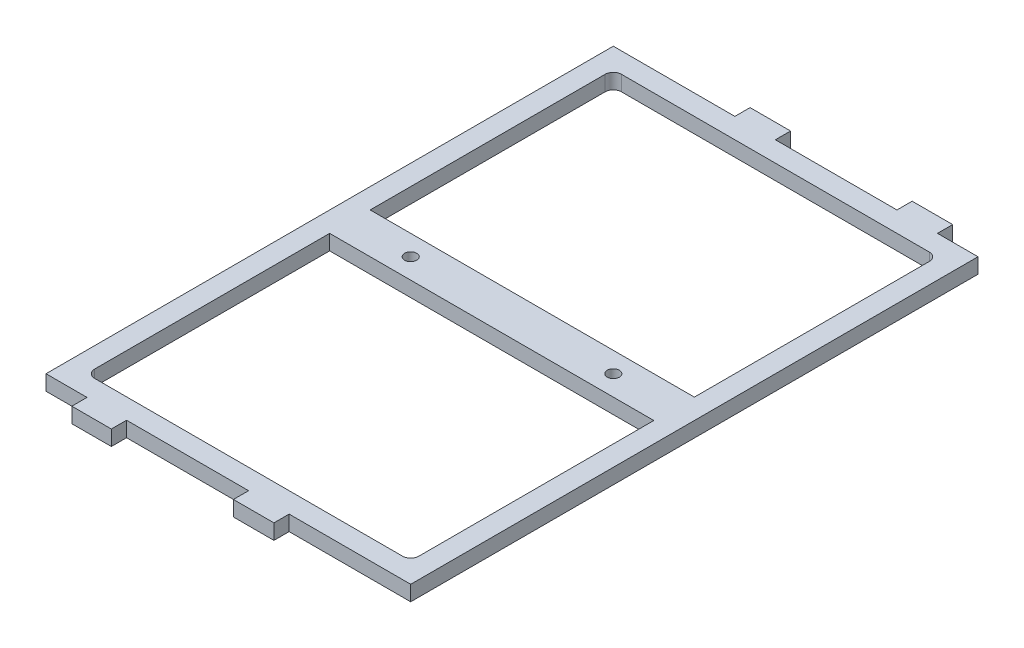
ISO-10303-21;
HEADER;
FILE_DESCRIPTION(('STEP AP214'),'2;1');
FILE_NAME('part.step','',(''),(''),'','','');
FILE_SCHEMA(('AUTOMOTIVE_DESIGN { 1 0 10303 214 1 1 1 1 }'));
ENDSEC;
DATA;
#1=APPLICATION_CONTEXT('core data for automotive mechanical design processes');
#2=APPLICATION_PROTOCOL_DEFINITION('international standard','automotive_design',2000,#1);
#3=PRODUCT_CONTEXT('',#1,'mechanical');
#4=PRODUCT('Part','Part','',(#3));
#5=PRODUCT_RELATED_PRODUCT_CATEGORY('part','',(#4));
#6=PRODUCT_DEFINITION_FORMATION('','',#4);
#7=PRODUCT_DEFINITION_CONTEXT('part definition',#1,'design');
#8=PRODUCT_DEFINITION('design','',#6,#7);
#9=PRODUCT_DEFINITION_SHAPE('','',#8);
#10=(LENGTH_UNIT() NAMED_UNIT(*) SI_UNIT(.MILLI.,.METRE.));
#11=(NAMED_UNIT(*) PLANE_ANGLE_UNIT() SI_UNIT($,.RADIAN.));
#12=(NAMED_UNIT(*) SI_UNIT($,.STERADIAN.) SOLID_ANGLE_UNIT());
#13=UNCERTAINTY_MEASURE_WITH_UNIT(LENGTH_MEASURE(1.E-05),#10,'distance_accuracy_value','');
#14=(GEOMETRIC_REPRESENTATION_CONTEXT(3) GLOBAL_UNCERTAINTY_ASSIGNED_CONTEXT((#13)) GLOBAL_UNIT_ASSIGNED_CONTEXT((#10,
#11,#12)) REPRESENTATION_CONTEXT('',''));
#15=CARTESIAN_POINT('',(0.,0.,0.));
#16=DIRECTION('',(0.,0.,1.));
#17=DIRECTION('',(1.,0.,0.));
#18=AXIS2_PLACEMENT_3D('',#15,#16,#17);
#19=CARTESIAN_POINT('',(-57.15,4.7625,88.9));
#20=DIRECTION('',(0.,-1.,0.));
#21=DIRECTION('',(0.,0.,-1.));
#22=AXIS2_PLACEMENT_3D('',#19,#20,#21);
#23=PLANE('',#22);
#24=CARTESIAN_POINT('',(-31.75,4.7625,0.));
#25=DIRECTION('',(0.,1.,0.));
#26=DIRECTION('',(0.,0.,1.));
#27=AXIS2_PLACEMENT_3D('',#24,#25,#26);
#28=CIRCLE('',#27,1.89864999999999);
#29=CARTESIAN_POINT('',(-31.75,4.7625,1.89864999999999));
#30=VERTEX_POINT('',#29);
#31=EDGE_CURVE('E645',#30,#30,#28,.T.);
#32=ORIENTED_EDGE('',*,*,#31,.F.);
#33=EDGE_LOOP('',(#32));
#34=FACE_BOUND('',#33,.T.);
#35=DIRECTION('',(0.,0.,-1.));
#36=VECTOR('',#35,1.);
#37=CARTESIAN_POINT('',(57.15,4.7625,-88.9));
#38=LINE('',#37,#36);
#39=CARTESIAN_POINT('',(57.15,4.7625,88.9));
#40=VERTEX_POINT('',#39);
#41=CARTESIAN_POINT('',(57.15,4.7625,-88.9));
#42=VERTEX_POINT('',#41);
#43=EDGE_CURVE('E369',#40,#42,#38,.T.);
#44=ORIENTED_EDGE('',*,*,#43,.T.);
#45=DIRECTION('',(-1.,0.,0.));
#46=VECTOR('',#45,1.);
#47=CARTESIAN_POINT('',(57.15,4.7625,-88.9));
#48=LINE('',#47,#46);
#49=CARTESIAN_POINT('',(44.45,4.7625,-88.9));
#50=VERTEX_POINT('',#49);
#51=EDGE_CURVE('E394',#42,#50,#48,.T.);
#52=ORIENTED_EDGE('',*,*,#51,.T.);
#53=DIRECTION('',(0.,0.,1.));
#54=VECTOR('',#53,1.);
#55=CARTESIAN_POINT('',(44.45,4.7625,-93.6625));
#56=LINE('',#55,#54);
#57=CARTESIAN_POINT('',(44.45,4.7625,-93.6625));
#58=VERTEX_POINT('',#57);
#59=EDGE_CURVE('E321',#58,#50,#56,.T.);
#60=ORIENTED_EDGE('',*,*,#59,.F.);
#61=DIRECTION('',(1.,0.,0.));
#62=VECTOR('',#61,1.);
#63=CARTESIAN_POINT('',(31.75,4.7625,-93.6625));
#64=LINE('',#63,#62);
#65=CARTESIAN_POINT('',(31.75,4.7625,-93.6625));
#66=VERTEX_POINT('',#65);
#67=EDGE_CURVE('E319',#66,#58,#64,.T.);
#68=ORIENTED_EDGE('',*,*,#67,.F.);
#69=DIRECTION('',(0.,0.,1.));
#70=VECTOR('',#69,1.);
#71=CARTESIAN_POINT('',(31.75,4.7625,-93.6625));
#72=LINE('',#71,#70);
#73=CARTESIAN_POINT('',(31.75,4.7625,-88.9));
#74=VERTEX_POINT('',#73);
#75=EDGE_CURVE('E334',#66,#74,#72,.T.);
#76=ORIENTED_EDGE('',*,*,#75,.T.);
#77=CARTESIAN_POINT('',(-6.35000000000004,4.7625,-88.9));
#78=VERTEX_POINT('',#77);
#79=EDGE_CURVE('E392',#74,#78,#48,.T.);
#80=ORIENTED_EDGE('',*,*,#79,.T.);
#81=DIRECTION('',(0.,0.,1.));
#82=VECTOR('',#81,1.);
#83=CARTESIAN_POINT('',(-6.35000000000004,4.7625,-93.6625));
#84=LINE('',#83,#82);
#85=CARTESIAN_POINT('',(-6.35000000000004,4.7625,-93.6625));
#86=VERTEX_POINT('',#85);
#87=EDGE_CURVE('E294',#86,#78,#84,.T.);
#88=ORIENTED_EDGE('',*,*,#87,.F.);
#89=DIRECTION('',(1.,0.,0.));
#90=VECTOR('',#89,1.);
#91=CARTESIAN_POINT('',(-19.05,4.7625,-93.6625));
#92=LINE('',#91,#90);
#93=CARTESIAN_POINT('',(-19.05,4.7625,-93.6625));
#94=VERTEX_POINT('',#93);
#95=EDGE_CURVE('E292',#94,#86,#92,.T.);
#96=ORIENTED_EDGE('',*,*,#95,.F.);
#97=DIRECTION('',(0.,0.,1.));
#98=VECTOR('',#97,1.);
#99=CARTESIAN_POINT('',(-19.05,4.7625,-93.6625));
#100=LINE('',#99,#98);
#101=CARTESIAN_POINT('',(-19.05,4.7625,-88.9));
#102=VERTEX_POINT('',#101);
#103=EDGE_CURVE('E301',#94,#102,#100,.T.);
#104=ORIENTED_EDGE('',*,*,#103,.T.);
#105=CARTESIAN_POINT('',(-57.15,4.7625,-88.9));
#106=VERTEX_POINT('',#105);
#107=EDGE_CURVE('E342',#102,#106,#48,.T.);
#108=ORIENTED_EDGE('',*,*,#107,.T.);
#109=DIRECTION('',(0.,0.,1.));
#110=VECTOR('',#109,1.);
#111=CARTESIAN_POINT('',(-57.15,4.7625,-88.9));
#112=LINE('',#111,#110);
#113=CARTESIAN_POINT('',(-57.15,4.7625,88.9));
#114=VERTEX_POINT('',#113);
#115=EDGE_CURVE('E358',#106,#114,#112,.T.);
#116=ORIENTED_EDGE('',*,*,#115,.T.);
#117=DIRECTION('',(1.,0.,0.));
#118=VECTOR('',#117,1.);
#119=CARTESIAN_POINT('',(57.15,4.7625,88.9));
#120=LINE('',#119,#118);
#121=CARTESIAN_POINT('',(-44.2933890202652,4.7625,88.9));
#122=VERTEX_POINT('',#121);
#123=EDGE_CURVE('E375',#114,#122,#120,.T.);
#124=ORIENTED_EDGE('',*,*,#123,.T.);
#125=DIRECTION('',(0.,0.,-1.));
#126=VECTOR('',#125,1.);
#127=CARTESIAN_POINT('',(-44.2933890202652,4.7625,93.6625));
#128=LINE('',#127,#126);
#129=CARTESIAN_POINT('',(-44.2933890202652,4.7625,93.6625));
#130=VERTEX_POINT('',#129);
#131=EDGE_CURVE('E477',#130,#122,#128,.T.);
#132=ORIENTED_EDGE('',*,*,#131,.F.);
#133=DIRECTION('',(-1.,0.,0.));
#134=VECTOR('',#133,1.);
#135=CARTESIAN_POINT('',(-31.9066109797348,4.7625,93.6625));
#136=LINE('',#135,#134);
#137=CARTESIAN_POINT('',(-31.9066109797348,4.7625,93.6625));
#138=VERTEX_POINT('',#137);
#139=EDGE_CURVE('E475',#138,#130,#136,.T.);
#140=ORIENTED_EDGE('',*,*,#139,.F.);
#141=DIRECTION('',(0.,0.,-1.));
#142=VECTOR('',#141,1.);
#143=CARTESIAN_POINT('',(-31.9066109797348,4.7625,93.6625));
#144=LINE('',#143,#142);
#145=CARTESIAN_POINT('',(-31.9066109797348,4.7625,88.9));
#146=VERTEX_POINT('',#145);
#147=EDGE_CURVE('E489',#138,#146,#144,.T.);
#148=ORIENTED_EDGE('',*,*,#147,.T.);
#149=CARTESIAN_POINT('',(6.35000000000001,4.7625,88.9));
#150=VERTEX_POINT('',#149);
#151=EDGE_CURVE('E362',#146,#150,#120,.T.);
#152=ORIENTED_EDGE('',*,*,#151,.T.);
#153=DIRECTION('',(0.,0.,-1.));
#154=VECTOR('',#153,1.);
#155=CARTESIAN_POINT('',(6.35,4.7625,93.6625));
#156=LINE('',#155,#154);
#157=CARTESIAN_POINT('',(6.35,4.7625,93.6625));
#158=VERTEX_POINT('',#157);
#159=EDGE_CURVE('E456',#158,#150,#156,.T.);
#160=ORIENTED_EDGE('',*,*,#159,.F.);
#161=DIRECTION('',(-1.,0.,0.));
#162=VECTOR('',#161,1.);
#163=CARTESIAN_POINT('',(19.05,4.7625,93.6625));
#164=LINE('',#163,#162);
#165=CARTESIAN_POINT('',(19.05,4.7625,93.6625));
#166=VERTEX_POINT('',#165);
#167=EDGE_CURVE('E453',#166,#158,#164,.T.);
#168=ORIENTED_EDGE('',*,*,#167,.F.);
#169=DIRECTION('',(0.,0.,-1.));
#170=VECTOR('',#169,1.);
#171=CARTESIAN_POINT('',(19.05,4.7625,93.6625));
#172=LINE('',#171,#170);
#173=CARTESIAN_POINT('',(19.05,4.7625,88.9));
#174=VERTEX_POINT('',#173);
#175=EDGE_CURVE('E458',#166,#174,#172,.T.);
#176=ORIENTED_EDGE('',*,*,#175,.T.);
#177=EDGE_CURVE('E359',#174,#40,#120,.T.);
#178=ORIENTED_EDGE('',*,*,#177,.T.);
#179=EDGE_LOOP('',(#44,#52,#60,#68,#76,#80,#88,#96,#104,#108,#116,#124,#132,#140,#148,#152,#160,
#168,#176,#178));
#180=FACE_BOUND('',#179,.T.);
#181=DIRECTION('',(1.,0.,0.));
#182=VECTOR('',#181,1.);
#183=CARTESIAN_POINT('',(57.15,4.7625,6.35));
#184=LINE('',#183,#182);
#185=CARTESIAN_POINT('',(-50.8,4.7625,6.35));
#186=VERTEX_POINT('',#185);
#187=CARTESIAN_POINT('',(50.8,4.7625,6.34999999999999));
#188=VERTEX_POINT('',#187);
#189=EDGE_CURVE('E248',#186,#188,#184,.T.);
#190=ORIENTED_EDGE('',*,*,#189,.T.);
#191=DIRECTION('',(0.,0.,-1.));
#192=VECTOR('',#191,1.);
#193=CARTESIAN_POINT('',(50.8,4.7625,-82.55));
#194=LINE('',#193,#192);
#195=CARTESIAN_POINT('',(50.8,4.7625,80.01));
#196=VERTEX_POINT('',#195);
#197=EDGE_CURVE('E49',#196,#188,#194,.T.);
#198=ORIENTED_EDGE('',*,*,#197,.F.);
#199=CARTESIAN_POINT('',(48.26,4.7625,80.01));
#200=DIRECTION('',(0.,-1.,0.));
#201=DIRECTION('',(0.,0.,-1.));
#202=AXIS2_PLACEMENT_3D('',#199,#200,#201);
#203=CIRCLE('',#202,2.54);
#204=CARTESIAN_POINT('',(48.26,4.7625,82.55));
#205=VERTEX_POINT('',#204);
#206=EDGE_CURVE('E545',#196,#205,#203,.T.);
#207=ORIENTED_EDGE('',*,*,#206,.T.);
#208=DIRECTION('',(1.,0.,0.));
#209=VECTOR('',#208,1.);
#210=CARTESIAN_POINT('',(50.8,4.7625,82.55));
#211=LINE('',#210,#209);
#212=CARTESIAN_POINT('',(-48.26,4.7625,82.55));
#213=VERTEX_POINT('',#212);
#214=EDGE_CURVE('E387',#213,#205,#211,.T.);
#215=ORIENTED_EDGE('',*,*,#214,.F.);
#216=CARTESIAN_POINT('',(-48.26,4.7625,80.0099999999999));
#217=DIRECTION('',(0.,-1.,0.));
#218=DIRECTION('',(0.,0.,-1.));
#219=AXIS2_PLACEMENT_3D('',#216,#217,#218);
#220=CIRCLE('',#219,2.54);
#221=CARTESIAN_POINT('',(-50.8,4.7625,80.0099999999999));
#222=VERTEX_POINT('',#221);
#223=EDGE_CURVE('E251',#213,#222,#220,.T.);
#224=ORIENTED_EDGE('',*,*,#223,.T.);
#225=DIRECTION('',(0.,0.,1.));
#226=VECTOR('',#225,1.);
#227=CARTESIAN_POINT('',(-50.8,4.7625,-82.55));
#228=LINE('',#227,#226);
#229=EDGE_CURVE('E244',#186,#222,#228,.T.);
#230=ORIENTED_EDGE('',*,*,#229,.F.);
#231=EDGE_LOOP('',(#190,#198,#207,#215,#224,#230));
#232=FACE_BOUND('',#231,.T.);
#233=DIRECTION('',(-1.,0.,0.));
#234=VECTOR('',#233,1.);
#235=CARTESIAN_POINT('',(57.15,4.7625,-6.35));
#236=LINE('',#235,#234);
#237=CARTESIAN_POINT('',(50.8,4.7625,-6.35));
#238=VERTEX_POINT('',#237);
#239=CARTESIAN_POINT('',(-50.8,4.7625,-6.34999999999999));
#240=VERTEX_POINT('',#239);
#241=EDGE_CURVE('E267',#238,#240,#236,.T.);
#242=ORIENTED_EDGE('',*,*,#241,.T.);
#243=CARTESIAN_POINT('',(-50.8,4.7625,-80.01));
#244=VERTEX_POINT('',#243);
#245=EDGE_CURVE('E255',#244,#240,#228,.T.);
#246=ORIENTED_EDGE('',*,*,#245,.F.);
#247=CARTESIAN_POINT('',(-48.26,4.7625,-80.01));
#248=DIRECTION('',(0.,-1.,0.));
#249=DIRECTION('',(0.,0.,-1.));
#250=AXIS2_PLACEMENT_3D('',#247,#248,#249);
#251=CIRCLE('',#250,2.54);
#252=CARTESIAN_POINT('',(-48.26,4.7625,-82.55));
#253=VERTEX_POINT('',#252);
#254=EDGE_CURVE('E571',#244,#253,#251,.T.);
#255=ORIENTED_EDGE('',*,*,#254,.T.);
#256=DIRECTION('',(-1.,0.,0.));
#257=VECTOR('',#256,1.);
#258=CARTESIAN_POINT('',(50.8,4.7625,-82.55));
#259=LINE('',#258,#257);
#260=CARTESIAN_POINT('',(48.26,4.7625,-82.55));
#261=VERTEX_POINT('',#260);
#262=EDGE_CURVE('E256',#261,#253,#259,.T.);
#263=ORIENTED_EDGE('',*,*,#262,.F.);
#264=CARTESIAN_POINT('',(48.26,4.7625,-80.01));
#265=DIRECTION('',(0.,-1.,0.));
#266=DIRECTION('',(0.,0.,-1.));
#267=AXIS2_PLACEMENT_3D('',#264,#265,#266);
#268=CIRCLE('',#267,2.54);
#269=CARTESIAN_POINT('',(50.8,4.7625,-80.01));
#270=VERTEX_POINT('',#269);
#271=EDGE_CURVE('E567',#261,#270,#268,.T.);
#272=ORIENTED_EDGE('',*,*,#271,.T.);
#273=EDGE_CURVE('E525',#238,#270,#194,.T.);
#274=ORIENTED_EDGE('',*,*,#273,.F.);
#275=EDGE_LOOP('',(#242,#246,#255,#263,#272,#274));
#276=FACE_BOUND('',#275,.T.);
#277=CARTESIAN_POINT('',(31.75,4.7625,0.));
#278=DIRECTION('',(0.,1.,0.));
#279=DIRECTION('',(0.,0.,1.));
#280=AXIS2_PLACEMENT_3D('',#277,#278,#279);
#281=CIRCLE('',#280,1.89864999999999);
#282=CARTESIAN_POINT('',(31.75,4.7625,1.89864999999999));
#283=VERTEX_POINT('',#282);
#284=EDGE_CURVE('E274',#283,#283,#281,.T.);
#285=ORIENTED_EDGE('',*,*,#284,.F.);
#286=EDGE_LOOP('',(#285));
#287=FACE_BOUND('',#286,.T.);
#288=ADVANCED_FACE('F33',(#34,#180,#232,#276,#287),#23,.F.);
#289=CARTESIAN_POINT('',(50.8,4.7625,-82.55));
#290=DIRECTION('',(-1.,0.,0.));
#291=DIRECTION('',(0.,0.,1.));
#292=AXIS2_PLACEMENT_3D('',#289,#290,#291);
#293=PLANE('',#292);
#294=DIRECTION('',(0.,-1.,0.));
#295=VECTOR('',#294,1.);
#296=CARTESIAN_POINT('',(50.8,4.7625,-6.34999999999999));
#297=LINE('',#296,#295);
#298=CARTESIAN_POINT('',(50.8,0.,-6.34999999999999));
#299=VERTEX_POINT('',#298);
#300=EDGE_CURVE('E281',#238,#299,#297,.T.);
#301=ORIENTED_EDGE('',*,*,#300,.F.);
#302=ORIENTED_EDGE('',*,*,#273,.T.);
#303=DIRECTION('',(0.,-1.,0.));
#304=VECTOR('',#303,1.);
#305=CARTESIAN_POINT('',(50.8,0.,-80.01));
#306=LINE('',#305,#304);
#307=CARTESIAN_POINT('',(50.8,0.,-80.01));
#308=VERTEX_POINT('',#307);
#309=EDGE_CURVE('E547',#270,#308,#306,.T.);
#310=ORIENTED_EDGE('',*,*,#309,.T.);
#311=DIRECTION('',(0.,0.,-1.));
#312=VECTOR('',#311,1.);
#313=CARTESIAN_POINT('',(50.8,0.,-82.55));
#314=LINE('',#313,#312);
#315=EDGE_CURVE('E57',#299,#308,#314,.T.);
#316=ORIENTED_EDGE('',*,*,#315,.F.);
#317=EDGE_LOOP('',(#301,#302,#310,#316));
#318=FACE_BOUND('',#317,.T.);
#319=ADVANCED_FACE('F590',(#318),#293,.T.);
#320=CARTESIAN_POINT('',(-50.8,4.7625,-82.55));
#321=DIRECTION('',(1.,0.,0.));
#322=DIRECTION('',(0.,0.,-1.));
#323=AXIS2_PLACEMENT_3D('',#320,#321,#322);
#324=PLANE('',#323);
#325=DIRECTION('',(0.,1.,0.));
#326=VECTOR('',#325,1.);
#327=CARTESIAN_POINT('',(-50.8,4.7625,-6.34999999999999));
#328=LINE('',#327,#326);
#329=CARTESIAN_POINT('',(-50.8,0.,-6.34999999999999));
#330=VERTEX_POINT('',#329);
#331=EDGE_CURVE('E11',#330,#240,#328,.T.);
#332=ORIENTED_EDGE('',*,*,#331,.F.);
#333=DIRECTION('',(0.,0.,1.));
#334=VECTOR('',#333,1.);
#335=CARTESIAN_POINT('',(-50.8,0.,-82.55));
#336=LINE('',#335,#334);
#337=CARTESIAN_POINT('',(-50.8,0.,-80.01));
#338=VERTEX_POINT('',#337);
#339=EDGE_CURVE('E521',#338,#330,#336,.T.);
#340=ORIENTED_EDGE('',*,*,#339,.F.);
#341=DIRECTION('',(0.,-1.,0.));
#342=VECTOR('',#341,1.);
#343=CARTESIAN_POINT('',(-50.8,4.7625,-80.01));
#344=LINE('',#343,#342);
#345=EDGE_CURVE('E561',#338,#244,#344,.F.);
#346=ORIENTED_EDGE('',*,*,#345,.T.);
#347=ORIENTED_EDGE('',*,*,#245,.T.);
#348=EDGE_LOOP('',(#332,#340,#346,#347));
#349=FACE_BOUND('',#348,.T.);
#350=ADVANCED_FACE('F596',(#349),#324,.T.);
#351=CARTESIAN_POINT('',(57.15,4.7625,-88.9));
#352=DIRECTION('',(0.,0.,1.));
#353=DIRECTION('',(1.,0.,0.));
#354=AXIS2_PLACEMENT_3D('',#351,#352,#353);
#355=PLANE('',#354);
#356=DIRECTION('',(0.,-1.,0.));
#357=VECTOR('',#356,1.);
#358=CARTESIAN_POINT('',(-6.35000000000004,4.7625,-88.9));
#359=LINE('',#358,#357);
#360=CARTESIAN_POINT('',(-6.35000000000004,0.,-88.9));
#361=VERTEX_POINT('',#360);
#362=EDGE_CURVE('E283',#78,#361,#359,.T.);
#363=ORIENTED_EDGE('',*,*,#362,.F.);
#364=ORIENTED_EDGE('',*,*,#79,.F.);
#365=DIRECTION('',(0.,1.,0.));
#366=VECTOR('',#365,1.);
#367=CARTESIAN_POINT('',(31.75,4.7625,-88.9));
#368=LINE('',#367,#366);
#369=CARTESIAN_POINT('',(31.75,0.,-88.9));
#370=VERTEX_POINT('',#369);
#371=EDGE_CURVE('E315',#370,#74,#368,.T.);
#372=ORIENTED_EDGE('',*,*,#371,.F.);
#373=DIRECTION('',(-1.,0.,0.));
#374=VECTOR('',#373,1.);
#375=CARTESIAN_POINT('',(57.15,0.,-88.9));
#376=LINE('',#375,#374);
#377=EDGE_CURVE('E340',#370,#361,#376,.T.);
#378=ORIENTED_EDGE('',*,*,#377,.T.);
#379=EDGE_LOOP('',(#363,#364,#372,#378));
#380=FACE_BOUND('',#379,.T.);
#381=ADVANCED_FACE('F611',(#380),#355,.F.);
#382=DIRECTION('',(0.,1.,0.));
#383=VECTOR('',#382,1.);
#384=CARTESIAN_POINT('',(-19.05,4.7625,-88.9));
#385=LINE('',#384,#383);
#386=CARTESIAN_POINT('',(-19.05,0.,-88.9));
#387=VERTEX_POINT('',#386);
#388=EDGE_CURVE('E288',#387,#102,#385,.T.);
#389=ORIENTED_EDGE('',*,*,#388,.F.);
#390=CARTESIAN_POINT('',(-57.15,0.,-88.9));
#391=VERTEX_POINT('',#390);
#392=EDGE_CURVE('E337',#387,#391,#376,.T.);
#393=ORIENTED_EDGE('',*,*,#392,.T.);
#394=DIRECTION('',(0.,-1.,0.));
#395=VECTOR('',#394,1.);
#396=CARTESIAN_POINT('',(-57.15,4.7625,-88.9));
#397=LINE('',#396,#395);
#398=EDGE_CURVE('E349',#106,#391,#397,.T.);
#399=ORIENTED_EDGE('',*,*,#398,.F.);
#400=ORIENTED_EDGE('',*,*,#107,.F.);
#401=EDGE_LOOP('',(#389,#393,#399,#400));
#402=FACE_BOUND('',#401,.T.);
#403=ADVANCED_FACE('F610',(#402),#355,.F.);
#404=DIRECTION('',(0.,-1.,0.));
#405=VECTOR('',#404,1.);
#406=CARTESIAN_POINT('',(44.45,4.7625,-88.9));
#407=LINE('',#406,#405);
#408=CARTESIAN_POINT('',(44.45,0.,-88.9));
#409=VERTEX_POINT('',#408);
#410=EDGE_CURVE('E310',#50,#409,#407,.T.);
#411=ORIENTED_EDGE('',*,*,#410,.F.);
#412=ORIENTED_EDGE('',*,*,#51,.F.);
#413=DIRECTION('',(0.,-1.,0.));
#414=VECTOR('',#413,1.);
#415=CARTESIAN_POINT('',(57.15,4.7625,-88.9));
#416=LINE('',#415,#414);
#417=CARTESIAN_POINT('',(57.15,0.,-88.9));
#418=VERTEX_POINT('',#417);
#419=EDGE_CURVE('E400',#42,#418,#416,.T.);
#420=ORIENTED_EDGE('',*,*,#419,.T.);
#421=EDGE_CURVE('E356',#418,#409,#376,.T.);
#422=ORIENTED_EDGE('',*,*,#421,.T.);
#423=EDGE_LOOP('',(#411,#412,#420,#422));
#424=FACE_BOUND('',#423,.T.);
#425=ADVANCED_FACE('F417',(#424),#355,.F.);
#426=CARTESIAN_POINT('',(57.15,4.7625,88.9));
#427=DIRECTION('',(0.,0.,-1.));
#428=DIRECTION('',(-1.,0.,0.));
#429=AXIS2_PLACEMENT_3D('',#426,#427,#428);
#430=PLANE('',#429);
#431=DIRECTION('',(0.,-1.,0.));
#432=VECTOR('',#431,1.);
#433=CARTESIAN_POINT('',(6.35,4.7625,88.9));
#434=LINE('',#433,#432);
#435=CARTESIAN_POINT('',(6.35000000000001,0.,88.9));
#436=VERTEX_POINT('',#435);
#437=EDGE_CURVE('E441',#150,#436,#434,.T.);
#438=ORIENTED_EDGE('',*,*,#437,.F.);
#439=ORIENTED_EDGE('',*,*,#151,.F.);
#440=DIRECTION('',(0.,1.,0.));
#441=VECTOR('',#440,1.);
#442=CARTESIAN_POINT('',(-31.9066109797348,4.7625,88.9));
#443=LINE('',#442,#441);
#444=CARTESIAN_POINT('',(-31.9066109797348,0.,88.9));
#445=VERTEX_POINT('',#444);
#446=EDGE_CURVE('E471',#445,#146,#443,.T.);
#447=ORIENTED_EDGE('',*,*,#446,.F.);
#448=DIRECTION('',(1.,0.,0.));
#449=VECTOR('',#448,1.);
#450=CARTESIAN_POINT('',(57.15,0.,88.9));
#451=LINE('',#450,#449);
#452=EDGE_CURVE('E378',#445,#436,#451,.T.);
#453=ORIENTED_EDGE('',*,*,#452,.T.);
#454=EDGE_LOOP('',(#438,#439,#447,#453));
#455=FACE_BOUND('',#454,.T.);
#456=ADVANCED_FACE('F609',(#455),#430,.F.);
#457=DIRECTION('',(0.,1.,0.));
#458=VECTOR('',#457,1.);
#459=CARTESIAN_POINT('',(19.05,4.7625,88.9));
#460=LINE('',#459,#458);
#461=CARTESIAN_POINT('',(19.05,0.,88.9));
#462=VERTEX_POINT('',#461);
#463=EDGE_CURVE('E444',#462,#174,#460,.T.);
#464=ORIENTED_EDGE('',*,*,#463,.F.);
#465=CARTESIAN_POINT('',(57.15,0.,88.9));
#466=VERTEX_POINT('',#465);
#467=EDGE_CURVE('E363',#462,#466,#451,.T.);
#468=ORIENTED_EDGE('',*,*,#467,.T.);
#469=DIRECTION('',(0.,-1.,0.));
#470=VECTOR('',#469,1.);
#471=CARTESIAN_POINT('',(57.15,4.7625,88.9));
#472=LINE('',#471,#470);
#473=EDGE_CURVE('E416',#40,#466,#472,.T.);
#474=ORIENTED_EDGE('',*,*,#473,.F.);
#475=ORIENTED_EDGE('',*,*,#177,.F.);
#476=EDGE_LOOP('',(#464,#468,#474,#475));
#477=FACE_BOUND('',#476,.T.);
#478=ADVANCED_FACE('F616',(#477),#430,.F.);
#479=DIRECTION('',(0.,-1.,0.));
#480=VECTOR('',#479,1.);
#481=CARTESIAN_POINT('',(-44.2933890202652,4.7625,88.9));
#482=LINE('',#481,#480);
#483=CARTESIAN_POINT('',(-44.2933890202652,0.,88.9));
#484=VERTEX_POINT('',#483);
#485=EDGE_CURVE('E466',#122,#484,#482,.T.);
#486=ORIENTED_EDGE('',*,*,#485,.F.);
#487=ORIENTED_EDGE('',*,*,#123,.F.);
#488=DIRECTION('',(0.,-1.,0.));
#489=VECTOR('',#488,1.);
#490=CARTESIAN_POINT('',(-57.15,4.7625,88.9));
#491=LINE('',#490,#489);
#492=CARTESIAN_POINT('',(-57.15,0.,88.9));
#493=VERTEX_POINT('',#492);
#494=EDGE_CURVE('E551',#114,#493,#491,.T.);
#495=ORIENTED_EDGE('',*,*,#494,.T.);
#496=EDGE_CURVE('E380',#493,#484,#451,.T.);
#497=ORIENTED_EDGE('',*,*,#496,.T.);
#498=EDGE_LOOP('',(#486,#487,#495,#497));
#499=FACE_BOUND('',#498,.T.);
#500=ADVANCED_FACE('F605',(#499),#430,.F.);
#501=CARTESIAN_POINT('',(-57.15,0.,88.9));
#502=DIRECTION('',(0.,-1.,0.));
#503=DIRECTION('',(0.,0.,-1.));
#504=AXIS2_PLACEMENT_3D('',#501,#502,#503);
#505=PLANE('',#504);
#506=CARTESIAN_POINT('',(-31.75,0.,0.));
#507=DIRECTION('',(0.,-1.,0.));
#508=DIRECTION('',(0.,0.,-1.));
#509=AXIS2_PLACEMENT_3D('',#506,#507,#508);
#510=CIRCLE('',#509,1.89864999999999);
#511=CARTESIAN_POINT('',(-31.75,0.,-1.89864999999999));
#512=VERTEX_POINT('',#511);
#513=EDGE_CURVE('E37',#512,#512,#510,.T.);
#514=ORIENTED_EDGE('',*,*,#513,.F.);
#515=EDGE_LOOP('',(#514));
#516=FACE_BOUND('',#515,.T.);
#517=CARTESIAN_POINT('',(31.75,0.,0.));
#518=DIRECTION('',(0.,-1.,0.));
#519=DIRECTION('',(0.,0.,-1.));
#520=AXIS2_PLACEMENT_3D('',#517,#518,#519);
#521=CIRCLE('',#520,1.89864999999999);
#522=CARTESIAN_POINT('',(31.75,0.,-1.89864999999999));
#523=VERTEX_POINT('',#522);
#524=EDGE_CURVE('E268',#523,#523,#521,.T.);
#525=ORIENTED_EDGE('',*,*,#524,.F.);
#526=EDGE_LOOP('',(#525));
#527=FACE_BOUND('',#526,.T.);
#528=ORIENTED_EDGE('',*,*,#339,.T.);
#529=DIRECTION('',(-1.,0.,0.));
#530=VECTOR('',#529,1.);
#531=CARTESIAN_POINT('',(57.15,0.,-6.35));
#532=LINE('',#531,#530);
#533=EDGE_CURVE('E277',#299,#330,#532,.T.);
#534=ORIENTED_EDGE('',*,*,#533,.F.);
#535=ORIENTED_EDGE('',*,*,#315,.T.);
#536=CARTESIAN_POINT('',(48.26,0.,-80.01));
#537=DIRECTION('',(0.,-1.,0.));
#538=DIRECTION('',(0.,0.,-1.));
#539=AXIS2_PLACEMENT_3D('',#536,#537,#538);
#540=CIRCLE('',#539,2.54);
#541=CARTESIAN_POINT('',(48.26,0.,-82.55));
#542=VERTEX_POINT('',#541);
#543=EDGE_CURVE('E565',#308,#542,#540,.F.);
#544=ORIENTED_EDGE('',*,*,#543,.T.);
#545=DIRECTION('',(-1.,0.,0.));
#546=VECTOR('',#545,1.);
#547=CARTESIAN_POINT('',(50.8,0.,-82.55));
#548=LINE('',#547,#546);
#549=CARTESIAN_POINT('',(-48.26,0.,-82.55));
#550=VERTEX_POINT('',#549);
#551=EDGE_CURVE('E516',#542,#550,#548,.T.);
#552=ORIENTED_EDGE('',*,*,#551,.T.);
#553=CARTESIAN_POINT('',(-48.26,0.,-80.01));
#554=DIRECTION('',(0.,-1.,0.));
#555=DIRECTION('',(0.,0.,-1.));
#556=AXIS2_PLACEMENT_3D('',#553,#554,#555);
#557=CIRCLE('',#556,2.54);
#558=EDGE_CURVE('E569',#550,#338,#557,.F.);
#559=ORIENTED_EDGE('',*,*,#558,.T.);
#560=EDGE_LOOP('',(#528,#534,#535,#544,#552,#559));
#561=FACE_BOUND('',#560,.T.);
#562=CARTESIAN_POINT('',(50.8,0.,80.01));
#563=VERTEX_POINT('',#562);
#564=CARTESIAN_POINT('',(50.8,0.,6.34999999999999));
#565=VERTEX_POINT('',#564);
#566=EDGE_CURVE('E510',#563,#565,#314,.T.);
#567=ORIENTED_EDGE('',*,*,#566,.T.);
#568=DIRECTION('',(1.,0.,0.));
#569=VECTOR('',#568,1.);
#570=CARTESIAN_POINT('',(57.15,0.,6.35));
#571=LINE('',#570,#569);
#572=CARTESIAN_POINT('',(-50.8,0.,6.34999999999999));
#573=VERTEX_POINT('',#572);
#574=EDGE_CURVE('E271',#573,#565,#571,.T.);
#575=ORIENTED_EDGE('',*,*,#574,.F.);
#576=CARTESIAN_POINT('',(-50.8,0.,80.0099999999999));
#577=VERTEX_POINT('',#576);
#578=EDGE_CURVE('E260',#573,#577,#336,.T.);
#579=ORIENTED_EDGE('',*,*,#578,.T.);
#580=CARTESIAN_POINT('',(-48.26,0.,80.0099999999999));
#581=DIRECTION('',(0.,-1.,0.));
#582=DIRECTION('',(0.,0.,-1.));
#583=AXIS2_PLACEMENT_3D('',#580,#581,#582);
#584=CIRCLE('',#583,2.54);
#585=CARTESIAN_POINT('',(-48.26,0.,82.55));
#586=VERTEX_POINT('',#585);
#587=EDGE_CURVE('E573',#577,#586,#584,.F.);
#588=ORIENTED_EDGE('',*,*,#587,.T.);
#589=DIRECTION('',(1.,0.,0.));
#590=VECTOR('',#589,1.);
#591=CARTESIAN_POINT('',(50.8,0.,82.55));
#592=LINE('',#591,#590);
#593=CARTESIAN_POINT('',(48.26,0.,82.55));
#594=VERTEX_POINT('',#593);
#595=EDGE_CURVE('E523',#586,#594,#592,.T.);
#596=ORIENTED_EDGE('',*,*,#595,.T.);
#597=CARTESIAN_POINT('',(48.26,0.,80.01));
#598=DIRECTION('',(0.,-1.,0.));
#599=DIRECTION('',(0.,0.,-1.));
#600=AXIS2_PLACEMENT_3D('',#597,#598,#599);
#601=CIRCLE('',#600,2.54);
#602=EDGE_CURVE('E546',#594,#563,#601,.F.);
#603=ORIENTED_EDGE('',*,*,#602,.T.);
#604=EDGE_LOOP('',(#567,#575,#579,#588,#596,#603));
#605=FACE_BOUND('',#604,.T.);
#606=ORIENTED_EDGE('',*,*,#421,.F.);
#607=DIRECTION('',(0.,0.,-1.));
#608=VECTOR('',#607,1.);
#609=CARTESIAN_POINT('',(57.15,0.,-88.9));
#610=LINE('',#609,#608);
#611=EDGE_CURVE('E341',#466,#418,#610,.T.);
#612=ORIENTED_EDGE('',*,*,#611,.F.);
#613=ORIENTED_EDGE('',*,*,#467,.F.);
#614=DIRECTION('',(0.,0.,-1.));
#615=VECTOR('',#614,1.);
#616=CARTESIAN_POINT('',(19.05,0.,93.6625));
#617=LINE('',#616,#615);
#618=CARTESIAN_POINT('',(19.05,0.,93.6625));
#619=VERTEX_POINT('',#618);
#620=EDGE_CURVE('E460',#619,#462,#617,.T.);
#621=ORIENTED_EDGE('',*,*,#620,.F.);
#622=DIRECTION('',(1.,0.,0.));
#623=VECTOR('',#622,1.);
#624=CARTESIAN_POINT('',(19.05,0.,93.6625));
#625=LINE('',#624,#623);
#626=CARTESIAN_POINT('',(6.35,0.,93.6625));
#627=VERTEX_POINT('',#626);
#628=EDGE_CURVE('E977',#627,#619,#625,.T.);
#629=ORIENTED_EDGE('',*,*,#628,.F.);
#630=DIRECTION('',(0.,0.,-1.));
#631=VECTOR('',#630,1.);
#632=CARTESIAN_POINT('',(6.35,0.,93.6625));
#633=LINE('',#632,#631);
#634=EDGE_CURVE('E463',#627,#436,#633,.T.);
#635=ORIENTED_EDGE('',*,*,#634,.T.);
#636=ORIENTED_EDGE('',*,*,#452,.F.);
#637=DIRECTION('',(0.,0.,-1.));
#638=VECTOR('',#637,1.);
#639=CARTESIAN_POINT('',(-31.9066109797348,0.,93.6625));
#640=LINE('',#639,#638);
#641=CARTESIAN_POINT('',(-31.9066109797348,0.,93.6625));
#642=VERTEX_POINT('',#641);
#643=EDGE_CURVE('E495',#642,#445,#640,.T.);
#644=ORIENTED_EDGE('',*,*,#643,.F.);
#645=DIRECTION('',(1.,0.,0.));
#646=VECTOR('',#645,1.);
#647=CARTESIAN_POINT('',(-31.9066109797348,0.,93.6625));
#648=LINE('',#647,#646);
#649=CARTESIAN_POINT('',(-44.2933890202652,0.,93.6625));
#650=VERTEX_POINT('',#649);
#651=EDGE_CURVE('E470',#650,#642,#648,.T.);
#652=ORIENTED_EDGE('',*,*,#651,.F.);
#653=DIRECTION('',(0.,0.,-1.));
#654=VECTOR('',#653,1.);
#655=CARTESIAN_POINT('',(-44.2933890202652,0.,93.6625));
#656=LINE('',#655,#654);
#657=EDGE_CURVE('E501',#650,#484,#656,.T.);
#658=ORIENTED_EDGE('',*,*,#657,.T.);
#659=ORIENTED_EDGE('',*,*,#496,.F.);
#660=DIRECTION('',(0.,0.,1.));
#661=VECTOR('',#660,1.);
#662=CARTESIAN_POINT('',(-57.15,0.,-88.9));
#663=LINE('',#662,#661);
#664=EDGE_CURVE('E384',#391,#493,#663,.T.);
#665=ORIENTED_EDGE('',*,*,#664,.F.);
#666=ORIENTED_EDGE('',*,*,#392,.F.);
#667=DIRECTION('',(0.,0.,1.));
#668=VECTOR('',#667,1.);
#669=CARTESIAN_POINT('',(-19.05,0.,-93.6625));
#670=LINE('',#669,#668);
#671=CARTESIAN_POINT('',(-19.05,0.,-93.6625));
#672=VERTEX_POINT('',#671);
#673=EDGE_CURVE('E304',#672,#387,#670,.T.);
#674=ORIENTED_EDGE('',*,*,#673,.F.);
#675=DIRECTION('',(-1.,0.,0.));
#676=VECTOR('',#675,1.);
#677=CARTESIAN_POINT('',(-19.05,0.,-93.6625));
#678=LINE('',#677,#676);
#679=CARTESIAN_POINT('',(-6.35000000000004,0.,-93.6625));
#680=VERTEX_POINT('',#679);
#681=EDGE_CURVE('E287',#680,#672,#678,.T.);
#682=ORIENTED_EDGE('',*,*,#681,.F.);
#683=DIRECTION('',(0.,0.,1.));
#684=VECTOR('',#683,1.);
#685=CARTESIAN_POINT('',(-6.35000000000004,0.,-93.6625));
#686=LINE('',#685,#684);
#687=EDGE_CURVE('E307',#680,#361,#686,.T.);
#688=ORIENTED_EDGE('',*,*,#687,.T.);
#689=ORIENTED_EDGE('',*,*,#377,.F.);
#690=DIRECTION('',(0.,0.,1.));
#691=VECTOR('',#690,1.);
#692=CARTESIAN_POINT('',(31.75,0.,-93.6625));
#693=LINE('',#692,#691);
#694=CARTESIAN_POINT('',(31.75,0.,-93.6625));
#695=VERTEX_POINT('',#694);
#696=EDGE_CURVE('E434',#695,#370,#693,.T.);
#697=ORIENTED_EDGE('',*,*,#696,.F.);
#698=DIRECTION('',(-1.,0.,0.));
#699=VECTOR('',#698,1.);
#700=CARTESIAN_POINT('',(31.75,0.,-93.6625));
#701=LINE('',#700,#699);
#702=CARTESIAN_POINT('',(44.45,0.,-93.6625));
#703=VERTEX_POINT('',#702);
#704=EDGE_CURVE('E314',#703,#695,#701,.T.);
#705=ORIENTED_EDGE('',*,*,#704,.F.);
#706=DIRECTION('',(0.,0.,1.));
#707=VECTOR('',#706,1.);
#708=CARTESIAN_POINT('',(44.45,0.,-93.6625));
#709=LINE('',#708,#707);
#710=EDGE_CURVE('E423',#703,#409,#709,.T.);
#711=ORIENTED_EDGE('',*,*,#710,.T.);
#712=EDGE_LOOP('',(#606,#612,#613,#621,#629,#635,#636,#644,#652,#658,#659,#665,#666,#674,#682,
#688,#689,#697,#705,#711));
#713=FACE_BOUND('',#712,.T.);
#714=ADVANCED_FACE('F576',(#516,#527,#561,#605,#713),#505,.T.);
#715=CARTESIAN_POINT('',(-57.15,4.7625,-88.9));
#716=DIRECTION('',(1.,0.,0.));
#717=DIRECTION('',(0.,0.,-1.));
#718=AXIS2_PLACEMENT_3D('',#715,#716,#717);
#719=PLANE('',#718);
#720=ORIENTED_EDGE('',*,*,#494,.F.);
#721=ORIENTED_EDGE('',*,*,#115,.F.);
#722=ORIENTED_EDGE('',*,*,#398,.T.);
#723=ORIENTED_EDGE('',*,*,#664,.T.);
#724=EDGE_LOOP('',(#720,#721,#722,#723));
#725=FACE_BOUND('',#724,.T.);
#726=ADVANCED_FACE('F604',(#725),#719,.F.);
#727=CARTESIAN_POINT('',(57.15,4.7625,-88.9));
#728=DIRECTION('',(-1.,0.,0.));
#729=DIRECTION('',(0.,0.,1.));
#730=AXIS2_PLACEMENT_3D('',#727,#728,#729);
#731=PLANE('',#730);
#732=ORIENTED_EDGE('',*,*,#611,.T.);
#733=ORIENTED_EDGE('',*,*,#419,.F.);
#734=ORIENTED_EDGE('',*,*,#43,.F.);
#735=ORIENTED_EDGE('',*,*,#473,.T.);
#736=EDGE_LOOP('',(#732,#733,#734,#735));
#737=FACE_BOUND('',#736,.T.);
#738=ADVANCED_FACE('F412',(#737),#731,.F.);
#739=DIRECTION('',(0.,1.,0.));
#740=VECTOR('',#739,1.);
#741=CARTESIAN_POINT('',(50.8,4.7625,6.34999999999999));
#742=LINE('',#741,#740);
#743=EDGE_CURVE('E266',#565,#188,#742,.T.);
#744=ORIENTED_EDGE('',*,*,#743,.F.);
#745=ORIENTED_EDGE('',*,*,#566,.F.);
#746=DIRECTION('',(0.,-1.,0.));
#747=VECTOR('',#746,1.);
#748=CARTESIAN_POINT('',(50.8,4.7625,80.01));
#749=LINE('',#748,#747);
#750=EDGE_CURVE('E549',#563,#196,#749,.F.);
#751=ORIENTED_EDGE('',*,*,#750,.T.);
#752=ORIENTED_EDGE('',*,*,#197,.T.);
#753=EDGE_LOOP('',(#744,#745,#751,#752));
#754=FACE_BOUND('',#753,.T.);
#755=ADVANCED_FACE('F598',(#754),#293,.T.);
#756=CARTESIAN_POINT('',(50.8,4.7625,-82.55));
#757=DIRECTION('',(0.,0.,1.));
#758=DIRECTION('',(1.,0.,0.));
#759=AXIS2_PLACEMENT_3D('',#756,#757,#758);
#760=PLANE('',#759);
#761=ORIENTED_EDGE('',*,*,#551,.F.);
#762=DIRECTION('',(0.,-1.,0.));
#763=VECTOR('',#762,1.);
#764=CARTESIAN_POINT('',(48.26,4.7625,-82.55));
#765=LINE('',#764,#763);
#766=EDGE_CURVE('E557',#542,#261,#765,.F.);
#767=ORIENTED_EDGE('',*,*,#766,.T.);
#768=ORIENTED_EDGE('',*,*,#262,.T.);
#769=DIRECTION('',(0.,-1.,0.));
#770=VECTOR('',#769,1.);
#771=CARTESIAN_POINT('',(-48.26,0.,-82.55));
#772=LINE('',#771,#770);
#773=EDGE_CURVE('E554',#253,#550,#772,.T.);
#774=ORIENTED_EDGE('',*,*,#773,.T.);
#775=EDGE_LOOP('',(#761,#767,#768,#774));
#776=FACE_BOUND('',#775,.T.);
#777=ADVANCED_FACE('F637',(#776),#760,.T.);
#778=DIRECTION('',(0.,-1.,0.));
#779=VECTOR('',#778,1.);
#780=CARTESIAN_POINT('',(-50.8,4.7625,6.34999999999999));
#781=LINE('',#780,#779);
#782=EDGE_CURVE('E42',#186,#573,#781,.T.);
#783=ORIENTED_EDGE('',*,*,#782,.F.);
#784=ORIENTED_EDGE('',*,*,#229,.T.);
#785=DIRECTION('',(0.,-1.,0.));
#786=VECTOR('',#785,1.);
#787=CARTESIAN_POINT('',(-50.8,0.,80.0099999999999));
#788=LINE('',#787,#786);
#789=EDGE_CURVE('E559',#222,#577,#788,.T.);
#790=ORIENTED_EDGE('',*,*,#789,.T.);
#791=ORIENTED_EDGE('',*,*,#578,.F.);
#792=EDGE_LOOP('',(#783,#784,#790,#791));
#793=FACE_BOUND('',#792,.T.);
#794=ADVANCED_FACE('F259',(#793),#324,.T.);
#795=CARTESIAN_POINT('',(50.8,4.7625,82.55));
#796=DIRECTION('',(0.,0.,-1.));
#797=DIRECTION('',(-1.,0.,0.));
#798=AXIS2_PLACEMENT_3D('',#795,#796,#797);
#799=PLANE('',#798);
#800=ORIENTED_EDGE('',*,*,#214,.T.);
#801=DIRECTION('',(0.,-1.,0.));
#802=VECTOR('',#801,1.);
#803=CARTESIAN_POINT('',(48.26,0.,82.55));
#804=LINE('',#803,#802);
#805=EDGE_CURVE('E538',#205,#594,#804,.T.);
#806=ORIENTED_EDGE('',*,*,#805,.T.);
#807=ORIENTED_EDGE('',*,*,#595,.F.);
#808=DIRECTION('',(0.,-1.,0.));
#809=VECTOR('',#808,1.);
#810=CARTESIAN_POINT('',(-48.26,4.7625,82.55));
#811=LINE('',#810,#809);
#812=EDGE_CURVE('E540',#586,#213,#811,.F.);
#813=ORIENTED_EDGE('',*,*,#812,.T.);
#814=EDGE_LOOP('',(#800,#806,#807,#813));
#815=FACE_BOUND('',#814,.T.);
#816=ADVANCED_FACE('F537',(#815),#799,.T.);
#817=CARTESIAN_POINT('',(-44.2933890202652,4.7625,93.6625));
#818=DIRECTION('',(1.,0.,0.));
#819=DIRECTION('',(0.,0.,-1.));
#820=AXIS2_PLACEMENT_3D('',#817,#818,#819);
#821=PLANE('',#820);
#822=ORIENTED_EDGE('',*,*,#485,.T.);
#823=ORIENTED_EDGE('',*,*,#657,.F.);
#824=DIRECTION('',(0.,-1.,0.));
#825=VECTOR('',#824,1.);
#826=CARTESIAN_POINT('',(-44.2933890202652,4.7625,93.6625));
#827=LINE('',#826,#825);
#828=EDGE_CURVE('E467',#130,#650,#827,.T.);
#829=ORIENTED_EDGE('',*,*,#828,.F.);
#830=ORIENTED_EDGE('',*,*,#131,.T.);
#831=EDGE_LOOP('',(#822,#823,#829,#830));
#832=FACE_BOUND('',#831,.T.);
#833=ADVANCED_FACE('F702',(#832),#821,.F.);
#834=CARTESIAN_POINT('',(-31.9066109797348,4.7625,93.6625));
#835=DIRECTION('',(-1.,0.,0.));
#836=DIRECTION('',(0.,0.,1.));
#837=AXIS2_PLACEMENT_3D('',#834,#835,#836);
#838=PLANE('',#837);
#839=ORIENTED_EDGE('',*,*,#446,.T.);
#840=ORIENTED_EDGE('',*,*,#147,.F.);
#841=DIRECTION('',(0.,1.,0.));
#842=VECTOR('',#841,1.);
#843=CARTESIAN_POINT('',(-31.9066109797348,4.7625,93.6625));
#844=LINE('',#843,#842);
#845=EDGE_CURVE('E473',#642,#138,#844,.T.);
#846=ORIENTED_EDGE('',*,*,#845,.F.);
#847=ORIENTED_EDGE('',*,*,#643,.T.);
#848=EDGE_LOOP('',(#839,#840,#846,#847));
#849=FACE_BOUND('',#848,.T.);
#850=ADVANCED_FACE('F698',(#849),#838,.F.);
#851=CARTESIAN_POINT('',(-44.2933890202652,0.,93.6625));
#852=DIRECTION('',(0.,0.,-1.));
#853=DIRECTION('',(-1.,0.,0.));
#854=AXIS2_PLACEMENT_3D('',#851,#852,#853);
#855=PLANE('',#854);
#856=ORIENTED_EDGE('',*,*,#828,.T.);
#857=ORIENTED_EDGE('',*,*,#651,.T.);
#858=ORIENTED_EDGE('',*,*,#845,.T.);
#859=ORIENTED_EDGE('',*,*,#139,.T.);
#860=EDGE_LOOP('',(#856,#857,#858,#859));
#861=FACE_BOUND('',#860,.T.);
#862=ADVANCED_FACE('F695',(#861),#855,.F.);
#863=CARTESIAN_POINT('',(6.35,4.7625,93.6625));
#864=DIRECTION('',(1.,0.,0.));
#865=DIRECTION('',(0.,0.,-1.));
#866=AXIS2_PLACEMENT_3D('',#863,#864,#865);
#867=PLANE('',#866);
#868=ORIENTED_EDGE('',*,*,#437,.T.);
#869=ORIENTED_EDGE('',*,*,#634,.F.);
#870=DIRECTION('',(0.,-1.,0.));
#871=VECTOR('',#870,1.);
#872=CARTESIAN_POINT('',(6.35,4.7625,93.6625));
#873=LINE('',#872,#871);
#874=EDGE_CURVE('E450',#158,#627,#873,.T.);
#875=ORIENTED_EDGE('',*,*,#874,.F.);
#876=ORIENTED_EDGE('',*,*,#159,.T.);
#877=EDGE_LOOP('',(#868,#869,#875,#876));
#878=FACE_BOUND('',#877,.T.);
#879=ADVANCED_FACE('F691',(#878),#867,.F.);
#880=CARTESIAN_POINT('',(19.05,4.7625,93.6625));
#881=DIRECTION('',(-1.,0.,0.));
#882=DIRECTION('',(0.,0.,1.));
#883=AXIS2_PLACEMENT_3D('',#880,#881,#882);
#884=PLANE('',#883);
#885=ORIENTED_EDGE('',*,*,#463,.T.);
#886=ORIENTED_EDGE('',*,*,#175,.F.);
#887=DIRECTION('',(0.,1.,0.));
#888=VECTOR('',#887,1.);
#889=CARTESIAN_POINT('',(19.05,4.7625,93.6625));
#890=LINE('',#889,#888);
#891=EDGE_CURVE('E981',#619,#166,#890,.T.);
#892=ORIENTED_EDGE('',*,*,#891,.F.);
#893=ORIENTED_EDGE('',*,*,#620,.T.);
#894=EDGE_LOOP('',(#885,#886,#892,#893));
#895=FACE_BOUND('',#894,.T.);
#896=ADVANCED_FACE('F687',(#895),#884,.F.);
#897=CARTESIAN_POINT('',(6.35,0.,93.6625));
#898=DIRECTION('',(0.,0.,-1.));
#899=DIRECTION('',(-1.,0.,0.));
#900=AXIS2_PLACEMENT_3D('',#897,#898,#899);
#901=PLANE('',#900);
#902=ORIENTED_EDGE('',*,*,#874,.T.);
#903=ORIENTED_EDGE('',*,*,#628,.T.);
#904=ORIENTED_EDGE('',*,*,#891,.T.);
#905=ORIENTED_EDGE('',*,*,#167,.T.);
#906=EDGE_LOOP('',(#902,#903,#904,#905));
#907=FACE_BOUND('',#906,.T.);
#908=ADVANCED_FACE('F684',(#907),#901,.F.);
#909=CARTESIAN_POINT('',(44.45,4.7625,-93.6625));
#910=DIRECTION('',(-1.,0.,0.));
#911=DIRECTION('',(0.,0.,1.));
#912=AXIS2_PLACEMENT_3D('',#909,#910,#911);
#913=PLANE('',#912);
#914=ORIENTED_EDGE('',*,*,#410,.T.);
#915=ORIENTED_EDGE('',*,*,#710,.F.);
#916=DIRECTION('',(0.,-1.,0.));
#917=VECTOR('',#916,1.);
#918=CARTESIAN_POINT('',(44.45,4.7625,-93.6625));
#919=LINE('',#918,#917);
#920=EDGE_CURVE('E311',#58,#703,#919,.T.);
#921=ORIENTED_EDGE('',*,*,#920,.F.);
#922=ORIENTED_EDGE('',*,*,#59,.T.);
#923=EDGE_LOOP('',(#914,#915,#921,#922));
#924=FACE_BOUND('',#923,.T.);
#925=ADVANCED_FACE('F421',(#924),#913,.F.);
#926=CARTESIAN_POINT('',(31.75,4.7625,-93.6625));
#927=DIRECTION('',(1.,0.,0.));
#928=DIRECTION('',(0.,1.,0.));
#929=AXIS2_PLACEMENT_3D('',#926,#927,#928);
#930=PLANE('',#929);
#931=ORIENTED_EDGE('',*,*,#371,.T.);
#932=ORIENTED_EDGE('',*,*,#75,.F.);
#933=DIRECTION('',(0.,1.,0.));
#934=VECTOR('',#933,1.);
#935=CARTESIAN_POINT('',(31.75,4.7625,-93.6625));
#936=LINE('',#935,#934);
#937=EDGE_CURVE('E317',#695,#66,#936,.T.);
#938=ORIENTED_EDGE('',*,*,#937,.F.);
#939=ORIENTED_EDGE('',*,*,#696,.T.);
#940=EDGE_LOOP('',(#931,#932,#938,#939));
#941=FACE_BOUND('',#940,.T.);
#942=ADVANCED_FACE('F433',(#941),#930,.F.);
#943=CARTESIAN_POINT('',(44.45,0.,-93.6625));
#944=DIRECTION('',(0.,0.,1.));
#945=DIRECTION('',(1.,0.,0.));
#946=AXIS2_PLACEMENT_3D('',#943,#944,#945);
#947=PLANE('',#946);
#948=ORIENTED_EDGE('',*,*,#920,.T.);
#949=ORIENTED_EDGE('',*,*,#704,.T.);
#950=ORIENTED_EDGE('',*,*,#937,.T.);
#951=ORIENTED_EDGE('',*,*,#67,.T.);
#952=EDGE_LOOP('',(#948,#949,#950,#951));
#953=FACE_BOUND('',#952,.T.);
#954=ADVANCED_FACE('F427',(#953),#947,.F.);
#955=CARTESIAN_POINT('',(-6.35000000000004,4.7625,-93.6625));
#956=DIRECTION('',(-1.,0.,0.));
#957=DIRECTION('',(0.,-1.,0.));
#958=AXIS2_PLACEMENT_3D('',#955,#956,#957);
#959=PLANE('',#958);
#960=ORIENTED_EDGE('',*,*,#362,.T.);
#961=ORIENTED_EDGE('',*,*,#687,.F.);
#962=DIRECTION('',(0.,-1.,0.));
#963=VECTOR('',#962,1.);
#964=CARTESIAN_POINT('',(-6.35000000000004,4.7625,-93.6625));
#965=LINE('',#964,#963);
#966=EDGE_CURVE('E284',#86,#680,#965,.T.);
#967=ORIENTED_EDGE('',*,*,#966,.F.);
#968=ORIENTED_EDGE('',*,*,#87,.T.);
#969=EDGE_LOOP('',(#960,#961,#967,#968));
#970=FACE_BOUND('',#969,.T.);
#971=ADVANCED_FACE('F673',(#970),#959,.F.);
#972=CARTESIAN_POINT('',(-19.05,4.7625,-93.6625));
#973=DIRECTION('',(1.,0.,0.));
#974=DIRECTION('',(0.,0.,-1.));
#975=AXIS2_PLACEMENT_3D('',#972,#973,#974);
#976=PLANE('',#975);
#977=ORIENTED_EDGE('',*,*,#388,.T.);
#978=ORIENTED_EDGE('',*,*,#103,.F.);
#979=DIRECTION('',(0.,1.,0.));
#980=VECTOR('',#979,1.);
#981=CARTESIAN_POINT('',(-19.05,4.7625,-93.6625));
#982=LINE('',#981,#980);
#983=EDGE_CURVE('E290',#672,#94,#982,.T.);
#984=ORIENTED_EDGE('',*,*,#983,.F.);
#985=ORIENTED_EDGE('',*,*,#673,.T.);
#986=EDGE_LOOP('',(#977,#978,#984,#985));
#987=FACE_BOUND('',#986,.T.);
#988=ADVANCED_FACE('F669',(#987),#976,.F.);
#989=CARTESIAN_POINT('',(-6.35000000000004,0.,-93.6625));
#990=DIRECTION('',(0.,0.,1.));
#991=DIRECTION('',(1.,0.,0.));
#992=AXIS2_PLACEMENT_3D('',#989,#990,#991);
#993=PLANE('',#992);
#994=ORIENTED_EDGE('',*,*,#966,.T.);
#995=ORIENTED_EDGE('',*,*,#681,.T.);
#996=ORIENTED_EDGE('',*,*,#983,.T.);
#997=ORIENTED_EDGE('',*,*,#95,.T.);
#998=EDGE_LOOP('',(#994,#995,#996,#997));
#999=FACE_BOUND('',#998,.T.);
#1000=ADVANCED_FACE('F623',(#999),#993,.F.);
#1001=CARTESIAN_POINT('',(48.26,4.7625,80.01));
#1002=DIRECTION('',(0.,1.,0.));
#1003=DIRECTION('',(0.,0.,1.));
#1004=AXIS2_PLACEMENT_3D('',#1001,#1002,#1003);
#1005=CYLINDRICAL_SURFACE('',#1004,2.54);
#1006=ORIENTED_EDGE('',*,*,#206,.F.);
#1007=ORIENTED_EDGE('',*,*,#750,.F.);
#1008=ORIENTED_EDGE('',*,*,#602,.F.);
#1009=ORIENTED_EDGE('',*,*,#805,.F.);
#1010=EDGE_LOOP('',(#1006,#1007,#1008,#1009));
#1011=FACE_BOUND('',#1010,.T.);
#1012=ADVANCED_FACE('F543',(#1011),#1005,.F.);
#1013=CARTESIAN_POINT('',(48.26,4.7625,-80.01));
#1014=DIRECTION('',(0.,1.,0.));
#1015=DIRECTION('',(0.,0.,1.));
#1016=AXIS2_PLACEMENT_3D('',#1013,#1014,#1015);
#1017=CYLINDRICAL_SURFACE('',#1016,2.54);
#1018=ORIENTED_EDGE('',*,*,#271,.F.);
#1019=ORIENTED_EDGE('',*,*,#766,.F.);
#1020=ORIENTED_EDGE('',*,*,#543,.F.);
#1021=ORIENTED_EDGE('',*,*,#309,.F.);
#1022=EDGE_LOOP('',(#1018,#1019,#1020,#1021));
#1023=FACE_BOUND('',#1022,.T.);
#1024=ADVANCED_FACE('F587',(#1023),#1017,.F.);
#1025=CARTESIAN_POINT('',(-48.26,4.7625,-80.01));
#1026=DIRECTION('',(0.,1.,0.));
#1027=DIRECTION('',(0.,0.,1.));
#1028=AXIS2_PLACEMENT_3D('',#1025,#1026,#1027);
#1029=CYLINDRICAL_SURFACE('',#1028,2.54);
#1030=ORIENTED_EDGE('',*,*,#254,.F.);
#1031=ORIENTED_EDGE('',*,*,#345,.F.);
#1032=ORIENTED_EDGE('',*,*,#558,.F.);
#1033=ORIENTED_EDGE('',*,*,#773,.F.);
#1034=EDGE_LOOP('',(#1030,#1031,#1032,#1033));
#1035=FACE_BOUND('',#1034,.T.);
#1036=ADVANCED_FACE('F580',(#1035),#1029,.F.);
#1037=CARTESIAN_POINT('',(-48.26,4.7625,80.0099999999999));
#1038=DIRECTION('',(0.,1.,0.));
#1039=DIRECTION('',(0.,0.,1.));
#1040=AXIS2_PLACEMENT_3D('',#1037,#1038,#1039);
#1041=CYLINDRICAL_SURFACE('',#1040,2.54);
#1042=ORIENTED_EDGE('',*,*,#223,.F.);
#1043=ORIENTED_EDGE('',*,*,#812,.F.);
#1044=ORIENTED_EDGE('',*,*,#587,.F.);
#1045=ORIENTED_EDGE('',*,*,#789,.F.);
#1046=EDGE_LOOP('',(#1042,#1043,#1044,#1045));
#1047=FACE_BOUND('',#1046,.T.);
#1048=ADVANCED_FACE('F35',(#1047),#1041,.F.);
#1049=CARTESIAN_POINT('',(57.15,0.,-6.35));
#1050=DIRECTION('',(0.,0.,-1.));
#1051=DIRECTION('',(-1.,0.,0.));
#1052=AXIS2_PLACEMENT_3D('',#1049,#1050,#1051);
#1053=PLANE('',#1052);
#1054=ORIENTED_EDGE('',*,*,#241,.F.);
#1055=ORIENTED_EDGE('',*,*,#300,.T.);
#1056=ORIENTED_EDGE('',*,*,#533,.T.);
#1057=ORIENTED_EDGE('',*,*,#331,.T.);
#1058=EDGE_LOOP('',(#1054,#1055,#1056,#1057));
#1059=FACE_BOUND('',#1058,.T.);
#1060=ADVANCED_FACE('F579',(#1059),#1053,.T.);
#1061=CARTESIAN_POINT('',(57.15,0.,6.35));
#1062=DIRECTION('',(0.,0.,1.));
#1063=DIRECTION('',(1.,0.,0.));
#1064=AXIS2_PLACEMENT_3D('',#1061,#1062,#1063);
#1065=PLANE('',#1064);
#1066=ORIENTED_EDGE('',*,*,#574,.T.);
#1067=ORIENTED_EDGE('',*,*,#743,.T.);
#1068=ORIENTED_EDGE('',*,*,#189,.F.);
#1069=ORIENTED_EDGE('',*,*,#782,.T.);
#1070=EDGE_LOOP('',(#1066,#1067,#1068,#1069));
#1071=FACE_BOUND('',#1070,.T.);
#1072=ADVANCED_FACE('F265',(#1071),#1065,.T.);
#1073=CARTESIAN_POINT('',(31.75,4.7625,0.));
#1074=DIRECTION('',(0.,1.,0.));
#1075=DIRECTION('',(0.,0.,1.));
#1076=AXIS2_PLACEMENT_3D('',#1073,#1074,#1075);
#1077=CYLINDRICAL_SURFACE('',#1076,1.89864999999999);
#1078=ORIENTED_EDGE('',*,*,#524,.T.);
#1079=EDGE_LOOP('',(#1078));
#1080=FACE_BOUND('',#1079,.T.);
#1081=ORIENTED_EDGE('',*,*,#284,.T.);
#1082=EDGE_LOOP('',(#1081));
#1083=FACE_BOUND('',#1082,.T.);
#1084=ADVANCED_FACE('F655',(#1080,#1083),#1077,.F.);
#1085=CARTESIAN_POINT('',(-31.75,4.7625,0.));
#1086=DIRECTION('',(0.,1.,0.));
#1087=DIRECTION('',(0.,0.,1.));
#1088=AXIS2_PLACEMENT_3D('',#1085,#1086,#1087);
#1089=CYLINDRICAL_SURFACE('',#1088,1.89864999999999);
#1090=ORIENTED_EDGE('',*,*,#513,.T.);
#1091=EDGE_LOOP('',(#1090));
#1092=FACE_BOUND('',#1091,.T.);
#1093=ORIENTED_EDGE('',*,*,#31,.T.);
#1094=EDGE_LOOP('',(#1093));
#1095=FACE_BOUND('',#1094,.T.);
#1096=ADVANCED_FACE('F651',(#1092,#1095),#1089,.F.);
#1097=CLOSED_SHELL('',(#288,#319,#350,#381,#403,#425,#456,#478,#500,#714,#726,#738,#755,#777,
#794,#816,#833,#850,#862,#879,#896,#908,#925,#942,#954,#971,#988,#1000,#1012,#1024,#1036,#1048,
#1060,#1072,#1084,#1096));
#1098=MANIFOLD_SOLID_BREP('B2',#1097);
#1099=ADVANCED_BREP_SHAPE_REPRESENTATION('',(#18,#1098),#14);
#1100=SHAPE_DEFINITION_REPRESENTATION(#9,#1099);
ENDSEC;
END-ISO-10303-21;
